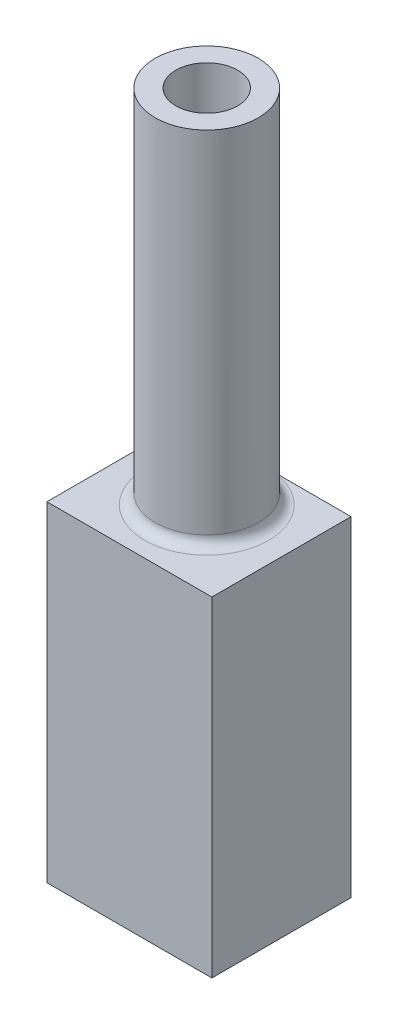
ISO-10303-21;
HEADER;
FILE_DESCRIPTION(('STEP AP214'),'2;1');
FILE_NAME('part.step','',(''),(''),'','','');
FILE_SCHEMA(('AUTOMOTIVE_DESIGN { 1 0 10303 214 1 1 1 1 }'));
ENDSEC;
DATA;
#1=APPLICATION_CONTEXT('core data for automotive mechanical design processes');
#2=APPLICATION_PROTOCOL_DEFINITION('international standard','automotive_design',2000,#1);
#3=PRODUCT_CONTEXT('',#1,'mechanical');
#4=PRODUCT('Part','Part','',(#3));
#5=PRODUCT_RELATED_PRODUCT_CATEGORY('part','',(#4));
#6=PRODUCT_DEFINITION_FORMATION('','',#4);
#7=PRODUCT_DEFINITION_CONTEXT('part definition',#1,'design');
#8=PRODUCT_DEFINITION('design','',#6,#7);
#9=PRODUCT_DEFINITION_SHAPE('','',#8);
#10=(LENGTH_UNIT() NAMED_UNIT(*) SI_UNIT(.MILLI.,.METRE.));
#11=(NAMED_UNIT(*) PLANE_ANGLE_UNIT() SI_UNIT($,.RADIAN.));
#12=(NAMED_UNIT(*) SI_UNIT($,.STERADIAN.) SOLID_ANGLE_UNIT());
#13=UNCERTAINTY_MEASURE_WITH_UNIT(LENGTH_MEASURE(1.E-05),#10,'distance_accuracy_value','');
#14=(GEOMETRIC_REPRESENTATION_CONTEXT(3) GLOBAL_UNCERTAINTY_ASSIGNED_CONTEXT((#13)) GLOBAL_UNIT_ASSIGNED_CONTEXT((#10,
#11,#12)) REPRESENTATION_CONTEXT('',''));
#15=CARTESIAN_POINT('',(0.,0.,0.));
#16=DIRECTION('',(0.,0.,1.));
#17=DIRECTION('',(1.,0.,0.));
#18=AXIS2_PLACEMENT_3D('',#15,#16,#17);
#19=CARTESIAN_POINT('',(8.,-16.,6.));
#20=DIRECTION('',(-1.,0.,0.));
#21=DIRECTION('',(0.,0.,1.));
#22=AXIS2_PLACEMENT_3D('',#19,#20,#21);
#23=PLANE('',#22);
#24=DIRECTION('',(0.,1.,0.));
#25=VECTOR('',#24,1.);
#26=CARTESIAN_POINT('',(8.,-16.,-6.));
#27=LINE('',#26,#25);
#28=CARTESIAN_POINT('',(8.,-16.,-6.));
#29=VERTEX_POINT('',#28);
#30=CARTESIAN_POINT('',(8.,16.,-6.));
#31=VERTEX_POINT('',#30);
#32=EDGE_CURVE('E161',#29,#31,#27,.T.);
#33=ORIENTED_EDGE('',*,*,#32,.T.);
#34=DIRECTION('',(0.,0.,-1.));
#35=VECTOR('',#34,1.);
#36=CARTESIAN_POINT('',(8.,16.,6.));
#37=LINE('',#36,#35);
#38=CARTESIAN_POINT('',(7.99999999999999,16.,7.5));
#39=VERTEX_POINT('',#38);
#40=EDGE_CURVE('E207',#39,#31,#37,.T.);
#41=ORIENTED_EDGE('',*,*,#40,.F.);
#42=DIRECTION('',(0.,1.,0.));
#43=VECTOR('',#42,1.);
#44=CARTESIAN_POINT('',(7.99999999999999,16.,7.5));
#45=LINE('',#44,#43);
#46=CARTESIAN_POINT('',(8.,-16.,7.5));
#47=VERTEX_POINT('',#46);
#48=EDGE_CURVE('E296',#47,#39,#45,.T.);
#49=ORIENTED_EDGE('',*,*,#48,.F.);
#50=DIRECTION('',(0.,0.,-1.));
#51=VECTOR('',#50,1.);
#52=CARTESIAN_POINT('',(8.,-16.,6.));
#53=LINE('',#52,#51);
#54=EDGE_CURVE('E160',#47,#29,#53,.T.);
#55=ORIENTED_EDGE('',*,*,#54,.T.);
#56=EDGE_LOOP('',(#33,#41,#49,#55));
#57=FACE_BOUND('',#56,.T.);
#58=ADVANCED_FACE('F37',(#57),#23,.F.);
#59=CARTESIAN_POINT('',(-8.,16.,6.));
#60=DIRECTION('',(0.,-1.,0.));
#61=DIRECTION('',(0.,0.,-1.));
#62=AXIS2_PLACEMENT_3D('',#59,#60,#61);
#63=PLANE('',#62);
#64=DIRECTION('',(-1.,0.,0.));
#65=VECTOR('',#64,1.);
#66=CARTESIAN_POINT('',(-8.,16.,-6.));
#67=LINE('',#66,#65);
#68=CARTESIAN_POINT('',(0.,16.,-6.));
#69=VERTEX_POINT('',#68);
#70=EDGE_CURVE('E166',#31,#69,#67,.T.);
#71=ORIENTED_EDGE('',*,*,#70,.T.);
#72=CARTESIAN_POINT('',(0.,16.,0.));
#73=DIRECTION('',(0.,-1.,0.));
#74=DIRECTION('',(0.,0.,-1.));
#75=AXIS2_PLACEMENT_3D('',#72,#73,#74);
#76=CIRCLE('',#75,6.);
#77=EDGE_CURVE('E11',#69,#69,#76,.T.);
#78=ORIENTED_EDGE('',*,*,#77,.T.);
#79=CARTESIAN_POINT('',(-8.,16.,-6.));
#80=VERTEX_POINT('',#79);
#81=EDGE_CURVE('E164',#69,#80,#67,.T.);
#82=ORIENTED_EDGE('',*,*,#81,.T.);
#83=DIRECTION('',(0.,0.,-1.));
#84=VECTOR('',#83,1.);
#85=CARTESIAN_POINT('',(-8.,16.,6.));
#86=LINE('',#85,#84);
#87=CARTESIAN_POINT('',(-8.,16.,7.5));
#88=VERTEX_POINT('',#87);
#89=EDGE_CURVE('E204',#88,#80,#86,.T.);
#90=ORIENTED_EDGE('',*,*,#89,.F.);
#91=DIRECTION('',(-1.,0.,0.));
#92=VECTOR('',#91,1.);
#93=CARTESIAN_POINT('',(-8.,16.,7.5));
#94=LINE('',#93,#92);
#95=EDGE_CURVE('E299',#39,#88,#94,.T.);
#96=ORIENTED_EDGE('',*,*,#95,.F.);
#97=ORIENTED_EDGE('',*,*,#40,.T.);
#98=EDGE_LOOP('',(#71,#78,#82,#90,#96,#97));
#99=FACE_BOUND('',#98,.T.);
#100=ADVANCED_FACE('F227',(#99),#63,.F.);
#101=CARTESIAN_POINT('',(-8.,-16.,6.));
#102=DIRECTION('',(1.,0.,0.));
#103=DIRECTION('',(0.,0.,-1.));
#104=AXIS2_PLACEMENT_3D('',#101,#102,#103);
#105=PLANE('',#104);
#106=DIRECTION('',(0.,-1.,0.));
#107=VECTOR('',#106,1.);
#108=CARTESIAN_POINT('',(-8.,-16.,-6.));
#109=LINE('',#108,#107);
#110=CARTESIAN_POINT('',(-8.,-16.,-6.));
#111=VERTEX_POINT('',#110);
#112=EDGE_CURVE('E168',#80,#111,#109,.T.);
#113=ORIENTED_EDGE('',*,*,#112,.T.);
#114=DIRECTION('',(0.,0.,-1.));
#115=VECTOR('',#114,1.);
#116=CARTESIAN_POINT('',(-8.,-16.,6.));
#117=LINE('',#116,#115);
#118=CARTESIAN_POINT('',(-8.,-16.,7.5));
#119=VERTEX_POINT('',#118);
#120=EDGE_CURVE('E201',#119,#111,#117,.T.);
#121=ORIENTED_EDGE('',*,*,#120,.F.);
#122=DIRECTION('',(0.,-1.,0.));
#123=VECTOR('',#122,1.);
#124=CARTESIAN_POINT('',(-8.,16.,7.5));
#125=LINE('',#124,#123);
#126=EDGE_CURVE('E287',#88,#119,#125,.T.);
#127=ORIENTED_EDGE('',*,*,#126,.F.);
#128=ORIENTED_EDGE('',*,*,#89,.T.);
#129=EDGE_LOOP('',(#113,#121,#127,#128));
#130=FACE_BOUND('',#129,.T.);
#131=ADVANCED_FACE('F232',(#130),#105,.F.);
#132=CARTESIAN_POINT('',(-4.,-14.,6.));
#133=DIRECTION('',(-1.,0.,0.));
#134=DIRECTION('',(0.,0.,1.));
#135=AXIS2_PLACEMENT_3D('',#132,#133,#134);
#136=PLANE('',#135);
#137=DIRECTION('',(0.,1.,0.));
#138=VECTOR('',#137,1.);
#139=CARTESIAN_POINT('',(-4.,-14.,-6.));
#140=LINE('',#139,#138);
#141=CARTESIAN_POINT('',(-4.,-16.,-6.));
#142=VERTEX_POINT('',#141);
#143=CARTESIAN_POINT('',(-4.,-14.,-6.));
#144=VERTEX_POINT('',#143);
#145=EDGE_CURVE('E172',#142,#144,#140,.T.);
#146=ORIENTED_EDGE('',*,*,#145,.T.);
#147=DIRECTION('',(0.,0.,-1.));
#148=VECTOR('',#147,1.);
#149=CARTESIAN_POINT('',(-4.,-14.,6.));
#150=LINE('',#149,#148);
#151=CARTESIAN_POINT('',(-4.,-14.,6.));
#152=VERTEX_POINT('',#151);
#153=EDGE_CURVE('E197',#152,#144,#150,.T.);
#154=ORIENTED_EDGE('',*,*,#153,.F.);
#155=DIRECTION('',(0.,1.,0.));
#156=VECTOR('',#155,1.);
#157=CARTESIAN_POINT('',(-4.,-14.,6.));
#158=LINE('',#157,#156);
#159=CARTESIAN_POINT('',(-4.,-16.,6.));
#160=VERTEX_POINT('',#159);
#161=EDGE_CURVE('E186',#160,#152,#158,.T.);
#162=ORIENTED_EDGE('',*,*,#161,.F.);
#163=DIRECTION('',(0.,0.,-1.));
#164=VECTOR('',#163,1.);
#165=CARTESIAN_POINT('',(-4.,-16.,6.));
#166=LINE('',#165,#164);
#167=EDGE_CURVE('E109',#160,#142,#166,.T.);
#168=ORIENTED_EDGE('',*,*,#167,.T.);
#169=EDGE_LOOP('',(#146,#154,#162,#168));
#170=FACE_BOUND('',#169,.T.);
#171=ADVANCED_FACE('F237',(#170),#136,.F.);
#172=CARTESIAN_POINT('',(-6.,-14.,6.));
#173=DIRECTION('',(0.,-1.,0.));
#174=DIRECTION('',(0.,0.,-1.));
#175=AXIS2_PLACEMENT_3D('',#172,#173,#174);
#176=PLANE('',#175);
#177=DIRECTION('',(-1.,0.,0.));
#178=VECTOR('',#177,1.);
#179=CARTESIAN_POINT('',(-6.,-14.,-6.));
#180=LINE('',#179,#178);
#181=CARTESIAN_POINT('',(-6.,-14.,-6.));
#182=VERTEX_POINT('',#181);
#183=EDGE_CURVE('E174',#144,#182,#180,.T.);
#184=ORIENTED_EDGE('',*,*,#183,.T.);
#185=DIRECTION('',(0.,0.,-1.));
#186=VECTOR('',#185,1.);
#187=CARTESIAN_POINT('',(-6.,-14.,6.));
#188=LINE('',#187,#186);
#189=CARTESIAN_POINT('',(-6.,-14.,6.));
#190=VERTEX_POINT('',#189);
#191=EDGE_CURVE('E194',#190,#182,#188,.T.);
#192=ORIENTED_EDGE('',*,*,#191,.F.);
#193=DIRECTION('',(-1.,0.,0.));
#194=VECTOR('',#193,1.);
#195=CARTESIAN_POINT('',(-6.,-14.,6.));
#196=LINE('',#195,#194);
#197=EDGE_CURVE('E306',#152,#190,#196,.T.);
#198=ORIENTED_EDGE('',*,*,#197,.F.);
#199=ORIENTED_EDGE('',*,*,#153,.T.);
#200=EDGE_LOOP('',(#184,#192,#198,#199));
#201=FACE_BOUND('',#200,.T.);
#202=ADVANCED_FACE('F241',(#201),#176,.F.);
#203=CARTESIAN_POINT('',(-6.,-14.,6.));
#204=DIRECTION('',(-1.,0.,0.));
#205=DIRECTION('',(0.,0.,1.));
#206=AXIS2_PLACEMENT_3D('',#203,#204,#205);
#207=PLANE('',#206);
#208=DIRECTION('',(0.,1.,0.));
#209=VECTOR('',#208,1.);
#210=CARTESIAN_POINT('',(-6.,-14.,-6.));
#211=LINE('',#210,#209);
#212=CARTESIAN_POINT('',(-6.,14.,-6.));
#213=VERTEX_POINT('',#212);
#214=EDGE_CURVE('E176',#182,#213,#211,.T.);
#215=ORIENTED_EDGE('',*,*,#214,.T.);
#216=DIRECTION('',(0.,0.,-1.));
#217=VECTOR('',#216,1.);
#218=CARTESIAN_POINT('',(-6.,14.,6.));
#219=LINE('',#218,#217);
#220=CARTESIAN_POINT('',(-6.,14.,6.));
#221=VERTEX_POINT('',#220);
#222=EDGE_CURVE('E191',#221,#213,#219,.T.);
#223=ORIENTED_EDGE('',*,*,#222,.F.);
#224=DIRECTION('',(0.,1.,0.));
#225=VECTOR('',#224,1.);
#226=CARTESIAN_POINT('',(-6.,-14.,6.));
#227=LINE('',#226,#225);
#228=EDGE_CURVE('E155',#190,#221,#227,.T.);
#229=ORIENTED_EDGE('',*,*,#228,.F.);
#230=ORIENTED_EDGE('',*,*,#191,.T.);
#231=EDGE_LOOP('',(#215,#223,#229,#230));
#232=FACE_BOUND('',#231,.T.);
#233=ADVANCED_FACE('F245',(#232),#207,.F.);
#234=CARTESIAN_POINT('',(-6.,14.,6.));
#235=DIRECTION('',(0.,1.,0.));
#236=DIRECTION('',(0.,0.,1.));
#237=AXIS2_PLACEMENT_3D('',#234,#235,#236);
#238=PLANE('',#237);
#239=CARTESIAN_POINT('',(0.,14.,0.));
#240=DIRECTION('',(0.,1.,0.));
#241=DIRECTION('',(0.,0.,1.));
#242=AXIS2_PLACEMENT_3D('',#239,#240,#241);
#243=CIRCLE('',#242,3.);
#244=CARTESIAN_POINT('',(0.,14.,3.));
#245=VERTEX_POINT('',#244);
#246=EDGE_CURVE('E284',#245,#245,#243,.F.);
#247=ORIENTED_EDGE('',*,*,#246,.F.);
#248=EDGE_LOOP('',(#247));
#249=FACE_BOUND('',#248,.T.);
#250=DIRECTION('',(1.,0.,0.));
#251=VECTOR('',#250,1.);
#252=CARTESIAN_POINT('',(-6.,14.,-6.));
#253=LINE('',#252,#251);
#254=CARTESIAN_POINT('',(6.,14.,-6.));
#255=VERTEX_POINT('',#254);
#256=EDGE_CURVE('E178',#213,#255,#253,.T.);
#257=ORIENTED_EDGE('',*,*,#256,.T.);
#258=DIRECTION('',(0.,0.,-1.));
#259=VECTOR('',#258,1.);
#260=CARTESIAN_POINT('',(6.,14.,6.));
#261=LINE('',#260,#259);
#262=CARTESIAN_POINT('',(6.,14.,6.));
#263=VERTEX_POINT('',#262);
#264=EDGE_CURVE('E139',#263,#255,#261,.T.);
#265=ORIENTED_EDGE('',*,*,#264,.F.);
#266=DIRECTION('',(1.,0.,0.));
#267=VECTOR('',#266,1.);
#268=CARTESIAN_POINT('',(-6.,14.,6.));
#269=LINE('',#268,#267);
#270=EDGE_CURVE('E153',#221,#263,#269,.T.);
#271=ORIENTED_EDGE('',*,*,#270,.F.);
#272=ORIENTED_EDGE('',*,*,#222,.T.);
#273=EDGE_LOOP('',(#257,#265,#271,#272));
#274=FACE_BOUND('',#273,.T.);
#275=ADVANCED_FACE('F249',(#249,#274),#238,.F.);
#276=CARTESIAN_POINT('',(6.,-14.,6.));
#277=DIRECTION('',(1.,0.,0.));
#278=DIRECTION('',(0.,0.,-1.));
#279=AXIS2_PLACEMENT_3D('',#276,#277,#278);
#280=PLANE('',#279);
#281=DIRECTION('',(0.,-1.,0.));
#282=VECTOR('',#281,1.);
#283=CARTESIAN_POINT('',(6.,-14.,-6.));
#284=LINE('',#283,#282);
#285=CARTESIAN_POINT('',(6.,-14.,-6.));
#286=VERTEX_POINT('',#285);
#287=EDGE_CURVE('E136',#255,#286,#284,.T.);
#288=ORIENTED_EDGE('',*,*,#287,.T.);
#289=DIRECTION('',(0.,0.,-1.));
#290=VECTOR('',#289,1.);
#291=CARTESIAN_POINT('',(6.,-14.,6.));
#292=LINE('',#291,#290);
#293=CARTESIAN_POINT('',(6.,-14.,6.));
#294=VERTEX_POINT('',#293);
#295=EDGE_CURVE('E128',#294,#286,#292,.T.);
#296=ORIENTED_EDGE('',*,*,#295,.F.);
#297=DIRECTION('',(0.,-1.,0.));
#298=VECTOR('',#297,1.);
#299=CARTESIAN_POINT('',(6.,-14.,6.));
#300=LINE('',#299,#298);
#301=EDGE_CURVE('E133',#263,#294,#300,.T.);
#302=ORIENTED_EDGE('',*,*,#301,.F.);
#303=ORIENTED_EDGE('',*,*,#264,.T.);
#304=EDGE_LOOP('',(#288,#296,#302,#303));
#305=FACE_BOUND('',#304,.T.);
#306=ADVANCED_FACE('F130',(#305),#280,.F.);
#307=CARTESIAN_POINT('',(4.,-14.,6.));
#308=DIRECTION('',(0.,-1.,0.));
#309=DIRECTION('',(0.,0.,-1.));
#310=AXIS2_PLACEMENT_3D('',#307,#308,#309);
#311=PLANE('',#310);
#312=DIRECTION('',(-1.,0.,0.));
#313=VECTOR('',#312,1.);
#314=CARTESIAN_POINT('',(4.,-14.,-6.));
#315=LINE('',#314,#313);
#316=CARTESIAN_POINT('',(4.,-14.,-6.));
#317=VERTEX_POINT('',#316);
#318=EDGE_CURVE('E181',#286,#317,#315,.T.);
#319=ORIENTED_EDGE('',*,*,#318,.T.);
#320=DIRECTION('',(0.,0.,-1.));
#321=VECTOR('',#320,1.);
#322=CARTESIAN_POINT('',(4.,-14.,6.));
#323=LINE('',#322,#321);
#324=CARTESIAN_POINT('',(4.,-14.,6.));
#325=VERTEX_POINT('',#324);
#326=EDGE_CURVE('E140',#325,#317,#323,.T.);
#327=ORIENTED_EDGE('',*,*,#326,.F.);
#328=DIRECTION('',(-1.,0.,0.));
#329=VECTOR('',#328,1.);
#330=CARTESIAN_POINT('',(4.,-14.,6.));
#331=LINE('',#330,#329);
#332=EDGE_CURVE('E143',#294,#325,#331,.T.);
#333=ORIENTED_EDGE('',*,*,#332,.F.);
#334=ORIENTED_EDGE('',*,*,#295,.T.);
#335=EDGE_LOOP('',(#319,#327,#333,#334));
#336=FACE_BOUND('',#335,.T.);
#337=ADVANCED_FACE('F144',(#336),#311,.F.);
#338=CARTESIAN_POINT('',(4.,-14.,6.));
#339=DIRECTION('',(1.,0.,0.));
#340=DIRECTION('',(0.,0.,-1.));
#341=AXIS2_PLACEMENT_3D('',#338,#339,#340);
#342=PLANE('',#341);
#343=DIRECTION('',(0.,-1.,0.));
#344=VECTOR('',#343,1.);
#345=CARTESIAN_POINT('',(4.,-14.,-6.));
#346=LINE('',#345,#344);
#347=CARTESIAN_POINT('',(4.,-16.,-6.));
#348=VERTEX_POINT('',#347);
#349=EDGE_CURVE('E183',#317,#348,#346,.T.);
#350=ORIENTED_EDGE('',*,*,#349,.T.);
#351=DIRECTION('',(0.,0.,-1.));
#352=VECTOR('',#351,1.);
#353=CARTESIAN_POINT('',(4.,-16.,6.));
#354=LINE('',#353,#352);
#355=CARTESIAN_POINT('',(4.,-16.,6.));
#356=VERTEX_POINT('',#355);
#357=EDGE_CURVE('E58',#356,#348,#354,.T.);
#358=ORIENTED_EDGE('',*,*,#357,.F.);
#359=DIRECTION('',(0.,-1.,0.));
#360=VECTOR('',#359,1.);
#361=CARTESIAN_POINT('',(4.,-14.,6.));
#362=LINE('',#361,#360);
#363=EDGE_CURVE('E147',#325,#356,#362,.T.);
#364=ORIENTED_EDGE('',*,*,#363,.F.);
#365=ORIENTED_EDGE('',*,*,#326,.T.);
#366=EDGE_LOOP('',(#350,#358,#364,#365));
#367=FACE_BOUND('',#366,.T.);
#368=ADVANCED_FACE('F258',(#367),#342,.F.);
#369=CARTESIAN_POINT('',(4.,-16.,6.));
#370=DIRECTION('',(0.,1.,0.));
#371=DIRECTION('',(0.,0.,1.));
#372=AXIS2_PLACEMENT_3D('',#369,#370,#371);
#373=PLANE('',#372);
#374=DIRECTION('',(1.,0.,0.));
#375=VECTOR('',#374,1.);
#376=CARTESIAN_POINT('',(4.,-16.,-6.));
#377=LINE('',#376,#375);
#378=EDGE_CURVE('E102',#348,#29,#377,.T.);
#379=ORIENTED_EDGE('',*,*,#378,.T.);
#380=ORIENTED_EDGE('',*,*,#54,.F.);
#381=DIRECTION('',(1.,0.,0.));
#382=VECTOR('',#381,1.);
#383=CARTESIAN_POINT('',(-8.,-16.,7.5));
#384=LINE('',#383,#382);
#385=EDGE_CURVE('E293',#119,#47,#384,.T.);
#386=ORIENTED_EDGE('',*,*,#385,.F.);
#387=ORIENTED_EDGE('',*,*,#120,.T.);
#388=DIRECTION('',(1.,0.,0.));
#389=VECTOR('',#388,1.);
#390=CARTESIAN_POINT('',(-8.,-16.,-6.));
#391=LINE('',#390,#389);
#392=EDGE_CURVE('E170',#111,#142,#391,.T.);
#393=ORIENTED_EDGE('',*,*,#392,.T.);
#394=ORIENTED_EDGE('',*,*,#167,.F.);
#395=DIRECTION('',(1.,0.,0.));
#396=VECTOR('',#395,1.);
#397=CARTESIAN_POINT('',(-8.,-16.,6.));
#398=LINE('',#397,#396);
#399=EDGE_CURVE('E285',#160,#356,#398,.T.);
#400=ORIENTED_EDGE('',*,*,#399,.T.);
#401=ORIENTED_EDGE('',*,*,#357,.T.);
#402=EDGE_LOOP('',(#379,#380,#386,#387,#393,#394,#400,#401));
#403=FACE_BOUND('',#402,.T.);
#404=ADVANCED_FACE('F261',(#403),#373,.F.);
#405=CARTESIAN_POINT('',(0.,0.,-6.));
#406=DIRECTION('',(0.,0.,-1.));
#407=DIRECTION('',(-1.,0.,0.));
#408=AXIS2_PLACEMENT_3D('',#405,#406,#407);
#409=PLANE('',#408);
#410=ORIENTED_EDGE('',*,*,#32,.F.);
#411=ORIENTED_EDGE('',*,*,#378,.F.);
#412=ORIENTED_EDGE('',*,*,#349,.F.);
#413=ORIENTED_EDGE('',*,*,#318,.F.);
#414=ORIENTED_EDGE('',*,*,#287,.F.);
#415=ORIENTED_EDGE('',*,*,#256,.F.);
#416=ORIENTED_EDGE('',*,*,#214,.F.);
#417=ORIENTED_EDGE('',*,*,#183,.F.);
#418=ORIENTED_EDGE('',*,*,#145,.F.);
#419=ORIENTED_EDGE('',*,*,#392,.F.);
#420=ORIENTED_EDGE('',*,*,#112,.F.);
#421=ORIENTED_EDGE('',*,*,#81,.F.);
#422=ORIENTED_EDGE('',*,*,#70,.F.);
#423=EDGE_LOOP('',(#410,#411,#412,#413,#414,#415,#416,#417,#418,#419,#420,#421,#422));
#424=FACE_BOUND('',#423,.T.);
#425=ADVANCED_FACE('F264',(#424),#409,.T.);
#426=CARTESIAN_POINT('',(0.,51.,0.));
#427=DIRECTION('',(0.,-1.,0.));
#428=DIRECTION('',(0.,0.,-1.));
#429=AXIS2_PLACEMENT_3D('',#426,#427,#428);
#430=CYLINDRICAL_SURFACE('',#429,5.);
#431=CARTESIAN_POINT('',(0.,17.,0.));
#432=DIRECTION('',(0.,-1.,0.));
#433=DIRECTION('',(0.,0.,-1.));
#434=AXIS2_PLACEMENT_3D('',#431,#432,#433);
#435=CIRCLE('',#434,5.);
#436=CARTESIAN_POINT('',(0.,17.,-5.));
#437=VERTEX_POINT('',#436);
#438=EDGE_CURVE('E45',#437,#437,#435,.F.);
#439=ORIENTED_EDGE('',*,*,#438,.T.);
#440=EDGE_LOOP('',(#439));
#441=FACE_BOUND('',#440,.T.);
#442=CARTESIAN_POINT('',(0.,51.,0.));
#443=DIRECTION('',(0.,1.,0.));
#444=DIRECTION('',(0.,0.,1.));
#445=AXIS2_PLACEMENT_3D('',#442,#443,#444);
#446=CIRCLE('',#445,5.);
#447=CARTESIAN_POINT('',(0.,51.,5.));
#448=VERTEX_POINT('',#447);
#449=EDGE_CURVE('E165',#448,#448,#446,.T.);
#450=ORIENTED_EDGE('',*,*,#449,.F.);
#451=EDGE_LOOP('',(#450));
#452=FACE_BOUND('',#451,.T.);
#453=ADVANCED_FACE('F212',(#441,#452),#430,.T.);
#454=CARTESIAN_POINT('',(0.,51.,0.));
#455=DIRECTION('',(0.,1.,0.));
#456=DIRECTION('',(0.,0.,1.));
#457=AXIS2_PLACEMENT_3D('',#454,#455,#456);
#458=PLANE('',#457);
#459=CARTESIAN_POINT('',(0.,51.,0.));
#460=DIRECTION('',(0.,1.,0.));
#461=DIRECTION('',(0.,0.,1.));
#462=AXIS2_PLACEMENT_3D('',#459,#460,#461);
#463=CIRCLE('',#462,3.);
#464=CARTESIAN_POINT('',(0.,51.,3.));
#465=VERTEX_POINT('',#464);
#466=EDGE_CURVE('E281',#465,#465,#463,.T.);
#467=ORIENTED_EDGE('',*,*,#466,.F.);
#468=EDGE_LOOP('',(#467));
#469=FACE_BOUND('',#468,.T.);
#470=ORIENTED_EDGE('',*,*,#449,.T.);
#471=EDGE_LOOP('',(#470));
#472=FACE_BOUND('',#471,.T.);
#473=ADVANCED_FACE('F216',(#469,#472),#458,.T.);
#474=CARTESIAN_POINT('',(0.,17.,0.));
#475=DIRECTION('',(0.,-1.,0.));
#476=DIRECTION('',(0.,0.,-1.));
#477=AXIS2_PLACEMENT_3D('',#474,#475,#476);
#478=TOROIDAL_SURFACE('',#477,6.,1.);
#479=ORIENTED_EDGE('',*,*,#77,.F.);
#480=EDGE_LOOP('',(#479));
#481=FACE_BOUND('',#480,.T.);
#482=ORIENTED_EDGE('',*,*,#438,.F.);
#483=EDGE_LOOP('',(#482));
#484=FACE_BOUND('',#483,.T.);
#485=ADVANCED_FACE('F39',(#481,#484),#478,.F.);
#486=CARTESIAN_POINT('',(0.,0.,6.));
#487=DIRECTION('',(0.,0.,1.));
#488=DIRECTION('',(1.,0.,0.));
#489=AXIS2_PLACEMENT_3D('',#486,#487,#488);
#490=PLANE('',#489);
#491=ORIENTED_EDGE('',*,*,#399,.F.);
#492=ORIENTED_EDGE('',*,*,#161,.T.);
#493=ORIENTED_EDGE('',*,*,#197,.T.);
#494=ORIENTED_EDGE('',*,*,#228,.T.);
#495=ORIENTED_EDGE('',*,*,#270,.T.);
#496=ORIENTED_EDGE('',*,*,#301,.T.);
#497=ORIENTED_EDGE('',*,*,#332,.T.);
#498=ORIENTED_EDGE('',*,*,#363,.T.);
#499=EDGE_LOOP('',(#491,#492,#493,#494,#495,#496,#497,#498));
#500=FACE_BOUND('',#499,.T.);
#501=ADVANCED_FACE('F150',(#500),#490,.F.);
#502=CARTESIAN_POINT('',(0.,0.,7.5));
#503=DIRECTION('',(0.,0.,1.));
#504=DIRECTION('',(1.,0.,0.));
#505=AXIS2_PLACEMENT_3D('',#502,#503,#504);
#506=PLANE('',#505);
#507=ORIENTED_EDGE('',*,*,#126,.T.);
#508=ORIENTED_EDGE('',*,*,#385,.T.);
#509=ORIENTED_EDGE('',*,*,#48,.T.);
#510=ORIENTED_EDGE('',*,*,#95,.T.);
#511=EDGE_LOOP('',(#507,#508,#509,#510));
#512=FACE_BOUND('',#511,.T.);
#513=ADVANCED_FACE('F222',(#512),#506,.T.);
#514=CARTESIAN_POINT('',(0.,-16.001,0.));
#515=DIRECTION('',(0.,1.,0.));
#516=DIRECTION('',(0.,0.,1.));
#517=AXIS2_PLACEMENT_3D('',#514,#515,#516);
#518=CYLINDRICAL_SURFACE('',#517,3.);
#519=ORIENTED_EDGE('',*,*,#466,.T.);
#520=EDGE_LOOP('',(#519));
#521=FACE_BOUND('',#520,.T.);
#522=ORIENTED_EDGE('',*,*,#246,.T.);
#523=EDGE_LOOP('',(#522));
#524=FACE_BOUND('',#523,.T.);
#525=ADVANCED_FACE('F272',(#521,#524),#518,.F.);
#526=CLOSED_SHELL('',(#58,#100,#131,#171,#202,#233,#275,#306,#337,#368,#404,#425,#453,#473,#485,
#501,#513,#525));
#527=MANIFOLD_SOLID_BREP('B2',#526);
#528=ADVANCED_BREP_SHAPE_REPRESENTATION('',(#18,#527),#14);
#529=SHAPE_DEFINITION_REPRESENTATION(#9,#528);
ENDSEC;
END-ISO-10303-21;
